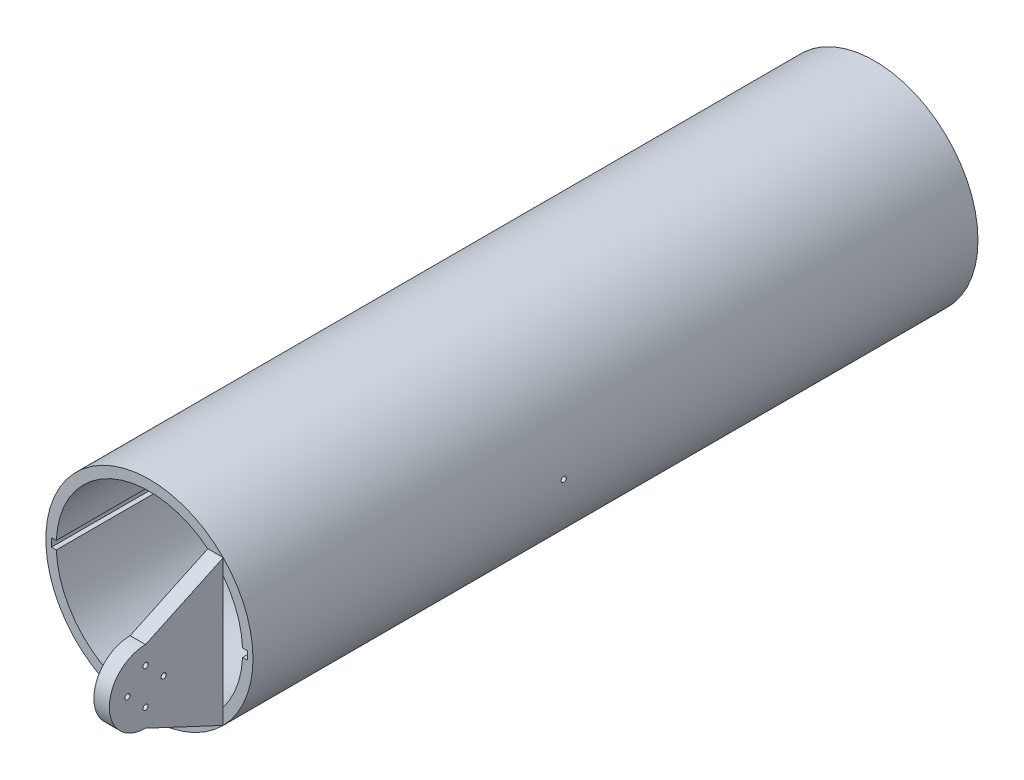
ISO-10303-21;
HEADER;
FILE_DESCRIPTION(('STEP AP214'),'2;1');
FILE_NAME('part.step','',(''),(''),'','','');
FILE_SCHEMA(('AUTOMOTIVE_DESIGN { 1 0 10303 214 1 1 1 1 }'));
ENDSEC;
DATA;
#1=APPLICATION_CONTEXT('core data for automotive mechanical design processes');
#2=APPLICATION_PROTOCOL_DEFINITION('international standard','automotive_design',2000,#1);
#3=PRODUCT_CONTEXT('',#1,'mechanical');
#4=PRODUCT('Part','Part','',(#3));
#5=PRODUCT_RELATED_PRODUCT_CATEGORY('part','',(#4));
#6=PRODUCT_DEFINITION_FORMATION('','',#4);
#7=PRODUCT_DEFINITION_CONTEXT('part definition',#1,'design');
#8=PRODUCT_DEFINITION('design','',#6,#7);
#9=PRODUCT_DEFINITION_SHAPE('','',#8);
#10=(LENGTH_UNIT() NAMED_UNIT(*) SI_UNIT(.MILLI.,.METRE.));
#11=(NAMED_UNIT(*) PLANE_ANGLE_UNIT() SI_UNIT($,.RADIAN.));
#12=(NAMED_UNIT(*) SI_UNIT($,.STERADIAN.) SOLID_ANGLE_UNIT());
#13=UNCERTAINTY_MEASURE_WITH_UNIT(LENGTH_MEASURE(1.E-05),#10,'distance_accuracy_value','');
#14=(GEOMETRIC_REPRESENTATION_CONTEXT(3) GLOBAL_UNCERTAINTY_ASSIGNED_CONTEXT((#13)) GLOBAL_UNIT_ASSIGNED_CONTEXT((#10,
#11,#12)) REPRESENTATION_CONTEXT('',''));
#15=CARTESIAN_POINT('',(0.,0.,0.));
#16=DIRECTION('',(0.,0.,1.));
#17=DIRECTION('',(1.,0.,0.));
#18=AXIS2_PLACEMENT_3D('',#15,#16,#17);
#19=CARTESIAN_POINT('',(0.,0.,-100.));
#20=DIRECTION('',(0.,0.,1.));
#21=DIRECTION('',(1.,0.,0.));
#22=AXIS2_PLACEMENT_3D('',#19,#20,#21);
#23=CYLINDRICAL_SURFACE('',#22,50.);
#24=CARTESIAN_POINT('',(-50.,0.,101.25));
#25=CARTESIAN_POINT('',(-49.9999997892433,-0.0702012806053509,101.249996890468));
#26=CARTESIAN_POINT('',(-49.9998505669129,-0.140453184521729,101.244066287815));
#27=CARTESIAN_POINT('',(-49.9992696347054,-0.279021411192673,101.220490687249));
#28=CARTESIAN_POINT('',(-49.9988375866143,-0.347335314234984,101.202831663669));
#29=CARTESIAN_POINT('',(-49.9977399359377,-0.480000032970664,101.156302971443));
#30=CARTESIAN_POINT('',(-49.9970744467966,-0.544352755839818,101.127438747421));
#31=CARTESIAN_POINT('',(-49.9955849996606,-0.66728119145738,101.059326712717));
#32=CARTESIAN_POINT('',(-49.9947610805834,-0.725858317628449,101.020081451217));
#33=CARTESIAN_POINT('',(-49.9930472282989,-0.835612011829375,100.932304373999));
#34=CARTESIAN_POINT('',(-49.9921572753778,-0.886786356266493,100.883769778147));
#35=CARTESIAN_POINT('',(-49.9904118342181,-0.980263255157657,100.778796235128));
#36=CARTESIAN_POINT('',(-49.9895563473475,-1.02256545779515,100.722356974657));
#37=CARTESIAN_POINT('',(-49.9879762331022,-1.09709940400727,100.603169665472));
#38=CARTESIAN_POINT('',(-49.9872516204449,-1.12933001528882,100.540420908464));
#39=CARTESIAN_POINT('',(-49.9860151168566,-1.1827984149725,100.410400905536));
#40=CARTESIAN_POINT('',(-49.9855032252025,-1.20403624074213,100.343129674991));
#41=CARTESIAN_POINT('',(-49.9847500083149,-1.23491198038136,100.205989232804));
#42=CARTESIAN_POINT('',(-49.9845086262981,-1.24455232873584,100.136120569578));
#43=CARTESIAN_POINT('',(-49.9843234739843,-1.25196695086035,99.9957562161149));
#44=CARTESIAN_POINT('',(-49.9843797026986,-1.24974126405586,99.925260527962));
#45=CARTESIAN_POINT('',(-49.9847833781213,-1.23348907585994,99.7856597612978));
#46=CARTESIAN_POINT('',(-49.9851307597476,-1.21946521174131,99.7165543755436));
#47=CARTESIAN_POINT('',(-49.9860774771185,-1.18001883030617,99.5816790450587));
#48=CARTESIAN_POINT('',(-49.9866768133296,-1.15459629188151,99.5159091065049));
#49=CARTESIAN_POINT('',(-49.9880599499198,-1.09307119196166,99.3895631952896));
#50=CARTESIAN_POINT('',(-49.988843771187,-1.0569674209775,99.3289878118357));
#51=CARTESIAN_POINT('',(-49.9905074926856,-0.975105623991352,99.21475701138));
#52=CARTESIAN_POINT('',(-49.9913873930577,-0.929347583862107,99.1611016045044));
#53=CARTESIAN_POINT('',(-49.9931443684604,-0.829461225210461,99.0622184655441));
#54=CARTESIAN_POINT('',(-49.9940214426512,-0.775330617915762,99.0169930454051));
#55=CARTESIAN_POINT('',(-49.9956736570713,-0.660243785237119,98.9362714726598));
#56=CARTESIAN_POINT('',(-49.9964487972851,-0.599287558820383,98.9007753215255));
#57=CARTESIAN_POINT('',(-49.9978097681651,-0.472278559451485,98.8405201705382));
#58=CARTESIAN_POINT('',(-49.9983955975763,-0.406225752717142,98.8157612418629));
#59=CARTESIAN_POINT('',(-49.9993118852416,-0.270899185047347,98.7776848280001));
#60=CARTESIAN_POINT('',(-49.9996423439818,-0.201625430244547,98.7643673210292));
#61=CARTESIAN_POINT('',(-50.0000105760241,-0.0618435041436848,98.7495546188588));
#62=CARTESIAN_POINT('',(-50.0000484285156,0.00866432799248807,98.7480562249943));
#63=CARTESIAN_POINT('',(-49.999827390649,0.148930569407979,98.7569159498476));
#64=CARTESIAN_POINT('',(-49.9995685005257,0.218688979279795,98.7672740591908));
#65=CARTESIAN_POINT('',(-49.9987832089567,0.355467259085124,98.7995501119755));
#66=CARTESIAN_POINT('',(-49.9982568410845,0.422487471571989,98.8214666046421));
#67=CARTESIAN_POINT('',(-49.9969959169746,0.551897387208432,98.876235815335));
#68=CARTESIAN_POINT('',(-49.9962613604543,0.614287084075191,98.9090885481995));
#69=CARTESIAN_POINT('',(-49.9946666309293,0.732679665489656,98.9848059046364));
#70=CARTESIAN_POINT('',(-49.9938064309167,0.788681172235662,99.0276726819793));
#71=CARTESIAN_POINT('',(-49.9920574600653,0.892693853571702,99.1221981272366));
#72=CARTESIAN_POINT('',(-49.9911686891723,0.940705013006051,99.1738568118267));
#73=CARTESIAN_POINT('',(-49.9894625477771,1.02738478773992,99.2845133569773));
#74=CARTESIAN_POINT('',(-49.9886451930737,1.06605133914107,99.3435128345125));
#75=CARTESIAN_POINT('',(-49.9871742851885,1.13293016503026,99.467167887786));
#76=CARTESIAN_POINT('',(-49.9865207316976,1.16114245925612,99.5318234528452));
#77=CARTESIAN_POINT('',(-49.9854512245261,1.20630831809067,99.6649475530868));
#78=CARTESIAN_POINT('',(-49.9850352425774,1.22326322223585,99.7334156335601));
#79=CARTESIAN_POINT('',(-49.9844876991685,1.24543740915402,99.8722276845196));
#80=CARTESIAN_POINT('',(-49.9843561376915,1.25065669262368,99.9425716548945));
#81=CARTESIAN_POINT('',(-49.9843922787728,1.24921131303956,100.08311792715));
#82=CARTESIAN_POINT('',(-49.9845598992096,1.242549911081,100.153320262613));
#83=CARTESIAN_POINT('',(-49.985175335134,1.21753894538223,100.291609864828));
#84=CARTESIAN_POINT('',(-49.98562315118,1.19918935835732,100.359697127367));
#85=CARTESIAN_POINT('',(-49.986748485414,1.15132321438058,100.49182541808));
#86=CARTESIAN_POINT('',(-49.9874260076321,1.12180646151248,100.555866375244));
#87=CARTESIAN_POINT('',(-49.9889343430816,1.05244537142006,100.678082151641));
#88=CARTESIAN_POINT('',(-49.9897651506242,1.01260141744787,100.736257188454));
#89=CARTESIAN_POINT('',(-49.9914866049636,0.92370883247783,100.845103812792));
#90=CARTESIAN_POINT('',(-49.992377261793,0.874658655736825,100.895774137701));
#91=CARTESIAN_POINT('',(-49.994118137793,0.768733478143212,100.988174453478));
#92=CARTESIAN_POINT('',(-49.9949683468844,0.711856540554558,101.02990222495));
#93=CARTESIAN_POINT('',(-49.9965327264857,0.591873911934435,101.103237927888));
#94=CARTESIAN_POINT('',(-49.9972468156398,0.528764529907139,101.134839814985));
#95=CARTESIAN_POINT('',(-49.998456932991,0.398183073403346,101.186962967462));
#96=CARTESIAN_POINT('',(-49.9989532215103,0.330716318304683,101.207497467673));
#97=CARTESIAN_POINT('',(-49.999538941339,0.219018516921423,101.231451616862));
#98=CARTESIAN_POINT('',(-49.9997110897919,0.175512722018037,101.238398530281));
#99=CARTESIAN_POINT('',(-49.9999416851822,0.0880112516517628,101.247673696205));
#100=CARTESIAN_POINT('',(-50.0000001321426,0.0440155762883697,101.250001949649));
#101=CARTESIAN_POINT('',(-50.,0.,101.25));
#102=B_SPLINE_CURVE_WITH_KNOTS('',3,(#24,#25,#26,#27,#28,#29,#30,#31,#32,#33,#34,#35,#36,#37,
#38,#39,#40,#41,#42,#43,#44,#45,#46,#47,#48,#49,#50,#51,#52,#53,#54,#55,#56,#57,#58,#59,#60,#61,
#62,#63,#64,#65,#66,#67,#68,#69,#70,#71,#72,#73,#74,#75,#76,#77,#78,#79,#80,#81,#82,#83,#84,#85,
#86,#87,#88,#89,#90,#91,#92,#93,#94,#95,#96,#97,#98,#99,#100,#101),.UNSPECIFIED.,.T.,.F.,(4,2,2,
2,2,2,2,2,2,2,2,2,2,2,2,2,2,2,2,2,2,2,2,2,2,2,2,2,2,2,2,2,2,2,2,2,2,2,4),(0.,0.210443181033347,
0.421138479019948,0.631731527740004,0.842272910862806,1.05287740411288,1.26349024711038,
1.47412675962819,1.68476255612964,1.89535412929105,2.10594500275222,2.31648881487096,
2.52703301687766,2.73760106897999,2.94816942921227,3.15879545366897,3.36942150999579,
3.58004896255672,3.79067601410156,4.00124606064959,4.21181594070732,4.42235939693014,
4.63290313881923,4.84349220516216,5.05408167093516,5.26471760616385,5.47535314370606,
5.68596361286427,5.89657406951998,6.10712672521302,6.3176798003613,6.5282365696147,
6.73878552602708,6.94936986570474,7.16000640860575,7.37076845199211,7.58127789517965,
7.71322391796614,7.84516991395463),.UNSPECIFIED.);
#103=CARTESIAN_POINT('',(-50.,0.,101.25));
#104=VERTEX_POINT('',#103);
#105=EDGE_CURVE('E265',#104,#104,#102,.T.);
#106=ORIENTED_EDGE('',*,*,#105,.T.);
#107=EDGE_LOOP('',(#106));
#108=FACE_BOUND('',#107,.T.);
#109=CARTESIAN_POINT('',(0.,0.,-100.));
#110=DIRECTION('',(0.,0.,1.));
#111=DIRECTION('',(1.,0.,0.));
#112=AXIS2_PLACEMENT_3D('',#109,#110,#111);
#113=CIRCLE('',#112,50.);
#114=CARTESIAN_POINT('',(50.,0.,-100.));
#115=VERTEX_POINT('',#114);
#116=EDGE_CURVE('E207',#115,#115,#113,.T.);
#117=ORIENTED_EDGE('',*,*,#116,.T.);
#118=EDGE_LOOP('',(#117));
#119=FACE_BOUND('',#118,.T.);
#120=CARTESIAN_POINT('',(0.,0.,250.));
#121=DIRECTION('',(0.,0.,1.));
#122=DIRECTION('',(1.,0.,0.));
#123=AXIS2_PLACEMENT_3D('',#120,#121,#122);
#124=CIRCLE('',#123,50.);
#125=CARTESIAN_POINT('',(35.6404264845415,35.0679340708858,250.));
#126=VERTEX_POINT('',#125);
#127=CARTESIAN_POINT('',(35.6404264845415,-35.0679340708858,250.));
#128=VERTEX_POINT('',#127);
#129=EDGE_CURVE('E134',#126,#128,#124,.T.);
#130=ORIENTED_EDGE('',*,*,#129,.F.);
#131=EDGE_CURVE('E145',#128,#126,#124,.T.);
#132=ORIENTED_EDGE('',*,*,#131,.F.);
#133=EDGE_LOOP('',(#130,#132));
#134=FACE_BOUND('',#133,.T.);
#135=CARTESIAN_POINT('',(50.,0.,98.75));
#136=CARTESIAN_POINT('',(49.9999997892433,-0.0702012806053509,98.7500031095318));
#137=CARTESIAN_POINT('',(49.9998505669129,-0.140453184521729,98.7559337121853));
#138=CARTESIAN_POINT('',(49.9992696347054,-0.279021411192673,98.7795093127506));
#139=CARTESIAN_POINT('',(49.9988375866143,-0.347335314234984,98.7971683363312));
#140=CARTESIAN_POINT('',(49.9977399359377,-0.480000032970663,98.843697028557));
#141=CARTESIAN_POINT('',(49.9970744467966,-0.544352755839814,98.8725612525791));
#142=CARTESIAN_POINT('',(49.9955849996606,-0.667281191457376,98.9406732872833));
#143=CARTESIAN_POINT('',(49.9947610805834,-0.725858317628445,98.979918548783));
#144=CARTESIAN_POINT('',(49.9930472282989,-0.83561201182937,99.0676956260013));
#145=CARTESIAN_POINT('',(49.9921572753778,-0.886786356266485,99.1162302218535));
#146=CARTESIAN_POINT('',(49.9904118342181,-0.980263255157651,99.221203764872));
#147=CARTESIAN_POINT('',(49.9895563473475,-1.02256545779515,99.2776430253426));
#148=CARTESIAN_POINT('',(49.9879762331022,-1.09709940400727,99.3968303345276));
#149=CARTESIAN_POINT('',(49.9872516204449,-1.12933001528882,99.4595790915363));
#150=CARTESIAN_POINT('',(49.9860151168566,-1.1827984149725,99.5895990944642));
#151=CARTESIAN_POINT('',(49.9855032252025,-1.20403624074213,99.6568703250093));
#152=CARTESIAN_POINT('',(49.9847500083149,-1.23491198038136,99.7940107671962));
#153=CARTESIAN_POINT('',(49.9845086262981,-1.24455232873584,99.8638794304222));
#154=CARTESIAN_POINT('',(49.9843234739843,-1.25196695086035,100.004243783885));
#155=CARTESIAN_POINT('',(49.9843797026986,-1.24974126405586,100.074739472038));
#156=CARTESIAN_POINT('',(49.9847833781213,-1.23348907585994,100.214340238702));
#157=CARTESIAN_POINT('',(49.9851307597476,-1.21946521174131,100.283445624456));
#158=CARTESIAN_POINT('',(49.9860774771185,-1.18001883030616,100.418320954941));
#159=CARTESIAN_POINT('',(49.9866768133296,-1.15459629188151,100.484090893495));
#160=CARTESIAN_POINT('',(49.9880599499198,-1.09307119196166,100.61043680471));
#161=CARTESIAN_POINT('',(49.988843771187,-1.0569674209775,100.671012188164));
#162=CARTESIAN_POINT('',(49.9905074926856,-0.975105623991352,100.78524298862));
#163=CARTESIAN_POINT('',(49.9913873930577,-0.929347583862107,100.838898395496));
#164=CARTESIAN_POINT('',(49.9931443684604,-0.829461225210461,100.937781534456));
#165=CARTESIAN_POINT('',(49.9940214426512,-0.775330617915762,100.983006954595));
#166=CARTESIAN_POINT('',(49.9956736570713,-0.660243785237119,101.06372852734));
#167=CARTESIAN_POINT('',(49.9964487972851,-0.599287558820383,101.099224678474));
#168=CARTESIAN_POINT('',(49.9978097681651,-0.472278559451484,101.159479829462));
#169=CARTESIAN_POINT('',(49.9983955975763,-0.406225752717139,101.184238758137));
#170=CARTESIAN_POINT('',(49.9993118852416,-0.270899185047344,101.222315172));
#171=CARTESIAN_POINT('',(49.9996423439818,-0.201625430244546,101.235632678971));
#172=CARTESIAN_POINT('',(50.0000105760241,-0.0618435041436857,101.250445381141));
#173=CARTESIAN_POINT('',(50.0000484285156,0.0086643279924863,101.251943775006));
#174=CARTESIAN_POINT('',(49.999827390649,0.148930569407977,101.243084050152));
#175=CARTESIAN_POINT('',(49.9995685005257,0.218688979279794,101.232725940809));
#176=CARTESIAN_POINT('',(49.9987832089567,0.355467259085124,101.200449888024));
#177=CARTESIAN_POINT('',(49.9982568410845,0.422487471571989,101.178533395358));
#178=CARTESIAN_POINT('',(49.9969959169746,0.551897387208432,101.123764184665));
#179=CARTESIAN_POINT('',(49.9962613604543,0.614287084075191,101.090911451801));
#180=CARTESIAN_POINT('',(49.9946666309293,0.732679665489651,101.015194095364));
#181=CARTESIAN_POINT('',(49.9938064309167,0.788681172235652,100.972327318021));
#182=CARTESIAN_POINT('',(49.9920574600653,0.892693853571693,100.877801872763));
#183=CARTESIAN_POINT('',(49.9911686891723,0.940705013006047,100.826143188173));
#184=CARTESIAN_POINT('',(49.9894625477771,1.02738478773992,100.715486643023));
#185=CARTESIAN_POINT('',(49.9886451930737,1.06605133914107,100.656487165487));
#186=CARTESIAN_POINT('',(49.9871742851885,1.13293016503026,100.532832112214));
#187=CARTESIAN_POINT('',(49.9865207316976,1.16114245925612,100.468176547155));
#188=CARTESIAN_POINT('',(49.9854512245261,1.20630831809067,100.335052446913));
#189=CARTESIAN_POINT('',(49.9850352425774,1.22326322223584,100.26658436644));
#190=CARTESIAN_POINT('',(49.9844876991685,1.24543740915402,100.12777231548));
#191=CARTESIAN_POINT('',(49.9843561376915,1.25065669262368,100.057428345106));
#192=CARTESIAN_POINT('',(49.9843922787728,1.24921131303956,99.9168820728496));
#193=CARTESIAN_POINT('',(49.9845598992096,1.242549911081,99.8466797373866));
#194=CARTESIAN_POINT('',(49.985175335134,1.21753894538223,99.7083901351715));
#195=CARTESIAN_POINT('',(49.98562315118,1.19918935835732,99.6403028726333));
#196=CARTESIAN_POINT('',(49.986748485414,1.15132321438058,99.5081745819201));
#197=CARTESIAN_POINT('',(49.9874260076321,1.12180646151248,99.4441336247564));
#198=CARTESIAN_POINT('',(49.9889343430816,1.05244537142006,99.3219178483587));
#199=CARTESIAN_POINT('',(49.9897651506242,1.01260141744787,99.2637428115462));
#200=CARTESIAN_POINT('',(49.9914866049636,0.92370883247783,99.1548961872083));
#201=CARTESIAN_POINT('',(49.992377261793,0.874658655736825,99.1042258622989));
#202=CARTESIAN_POINT('',(49.994118137793,0.768733478143212,99.0118255465219));
#203=CARTESIAN_POINT('',(49.9949683468844,0.711856540554558,98.97009777505));
#204=CARTESIAN_POINT('',(49.9965327264857,0.591873911934435,98.896762072112));
#205=CARTESIAN_POINT('',(49.9972468156398,0.528764529907139,98.8651601850151));
#206=CARTESIAN_POINT('',(49.998456932991,0.398183073403346,98.8130370325382));
#207=CARTESIAN_POINT('',(49.9989532215103,0.330716318304683,98.7925025323275));
#208=CARTESIAN_POINT('',(49.999538941339,0.219018516921423,98.7685483831377));
#209=CARTESIAN_POINT('',(49.9997110897919,0.175512722018037,98.7616014697195));
#210=CARTESIAN_POINT('',(49.9999416851822,0.0880112516517628,98.7523263037953));
#211=CARTESIAN_POINT('',(50.0000001321426,0.0440155762883697,98.7499980503513));
#212=CARTESIAN_POINT('',(50.,0.,98.75));
#213=B_SPLINE_CURVE_WITH_KNOTS('',3,(#135,#136,#137,#138,#139,#140,#141,#142,#143,#144,#145,
#146,#147,#148,#149,#150,#151,#152,#153,#154,#155,#156,#157,#158,#159,#160,#161,#162,#163,#164,
#165,#166,#167,#168,#169,#170,#171,#172,#173,#174,#175,#176,#177,#178,#179,#180,#181,#182,#183,
#184,#185,#186,#187,#188,#189,#190,#191,#192,#193,#194,#195,#196,#197,#198,#199,#200,#201,#202,
#203,#204,#205,#206,#207,#208,#209,#210,#211,#212),.UNSPECIFIED.,.T.,.F.,(4,2,2,2,2,2,2,2,2,2,2,
2,2,2,2,2,2,2,2,2,2,2,2,2,2,2,2,2,2,2,2,2,2,2,2,2,2,2,4),(0.,0.210443181033347,
0.421138479019948,0.631731527739999,0.842272910862806,1.05287740411285,1.26349024711038,
1.47412675962819,1.68476255612964,1.89535412929105,2.10594500275222,2.31648881487098,
2.52703301687767,2.73760106897999,2.94816942921227,3.15879545366897,3.3694215099958,
3.58004896255672,3.79067601410156,4.00124606064959,4.21181594070732,4.42235939693014,
4.63290313881924,4.84349220516214,5.05408167093516,5.26471760616385,5.47535314370606,
5.68596361286423,5.89657406951999,6.10712672521302,6.31767980036131,6.5282365696147,
6.73878552602708,6.94936986570474,7.16000640860575,7.37076845199211,7.58127789517965,
7.71322391796614,7.84516991395463),.UNSPECIFIED.);
#214=CARTESIAN_POINT('',(50.,0.,98.75));
#215=VERTEX_POINT('',#214);
#216=EDGE_CURVE('E155',#215,#215,#213,.T.);
#217=ORIENTED_EDGE('',*,*,#216,.T.);
#218=EDGE_LOOP('',(#217));
#219=FACE_BOUND('',#218,.T.);
#220=ADVANCED_FACE('F34',(#108,#119,#134,#219),#23,.T.);
#221=CARTESIAN_POINT('',(47.2555555555554,1.99950611185836,-100.));
#222=DIRECTION('',(1.,0.,0.));
#223=DIRECTION('',(0.,1.,0.));
#224=AXIS2_PLACEMENT_3D('',#221,#222,#223);
#225=PLANE('',#224);
#226=DIRECTION('',(0.,0.,1.));
#227=VECTOR('',#226,1.);
#228=CARTESIAN_POINT('',(47.2555555555555,-1.99950611185791,-100.));
#229=LINE('',#228,#227);
#230=CARTESIAN_POINT('',(47.2555555555555,-1.99950611185791,-100.));
#231=VERTEX_POINT('',#230);
#232=CARTESIAN_POINT('',(47.2555555555555,-1.99950611185791,250.));
#233=VERTEX_POINT('',#232);
#234=EDGE_CURVE('E210',#231,#233,#229,.T.);
#235=ORIENTED_EDGE('',*,*,#234,.T.);
#236=DIRECTION('',(0.,1.,0.));
#237=VECTOR('',#236,1.);
#238=CARTESIAN_POINT('',(47.2555555555554,1.99950611185836,250.));
#239=LINE('',#238,#237);
#240=CARTESIAN_POINT('',(47.2555555555554,1.99950611185836,250.));
#241=VERTEX_POINT('',#240);
#242=EDGE_CURVE('E179',#233,#241,#239,.T.);
#243=ORIENTED_EDGE('',*,*,#242,.T.);
#244=DIRECTION('',(0.,0.,1.));
#245=VECTOR('',#244,1.);
#246=CARTESIAN_POINT('',(47.2555555555554,1.99950611185836,-100.));
#247=LINE('',#246,#245);
#248=CARTESIAN_POINT('',(47.2555555555554,1.99950611185836,-100.));
#249=VERTEX_POINT('',#248);
#250=EDGE_CURVE('E208',#249,#241,#247,.T.);
#251=ORIENTED_EDGE('',*,*,#250,.F.);
#252=DIRECTION('',(0.,1.,0.));
#253=VECTOR('',#252,1.);
#254=CARTESIAN_POINT('',(47.2555555555554,1.99950611185836,-100.));
#255=LINE('',#254,#253);
#256=EDGE_CURVE('E198',#231,#249,#255,.T.);
#257=ORIENTED_EDGE('',*,*,#256,.F.);
#258=EDGE_LOOP('',(#235,#243,#251,#257));
#259=FACE_BOUND('',#258,.T.);
#260=CARTESIAN_POINT('',(47.2555555555555,0.,100.));
#261=DIRECTION('',(1.,0.,0.));
#262=DIRECTION('',(0.,1.,0.));
#263=AXIS2_PLACEMENT_3D('',#260,#261,#262);
#264=CIRCLE('',#263,1.25);
#265=CARTESIAN_POINT('',(47.2555555555554,1.25,100.));
#266=VERTEX_POINT('',#265);
#267=EDGE_CURVE('E228',#266,#266,#264,.F.);
#268=ORIENTED_EDGE('',*,*,#267,.F.);
#269=EDGE_LOOP('',(#268));
#270=FACE_BOUND('',#269,.T.);
#271=ADVANCED_FACE('F304',(#259,#270),#225,.F.);
#272=CARTESIAN_POINT('',(-47.2555555555556,1.99950611185813,-100.));
#273=DIRECTION('',(-1.,0.,0.));
#274=DIRECTION('',(0.,0.,1.));
#275=AXIS2_PLACEMENT_3D('',#272,#273,#274);
#276=PLANE('',#275);
#277=DIRECTION('',(0.,0.,1.));
#278=VECTOR('',#277,1.);
#279=CARTESIAN_POINT('',(-47.2555555555556,1.99950611185813,-100.));
#280=LINE('',#279,#278);
#281=CARTESIAN_POINT('',(-47.2555555555556,1.99950611185813,-100.));
#282=VERTEX_POINT('',#281);
#283=CARTESIAN_POINT('',(-47.2555555555556,1.99950611185813,250.));
#284=VERTEX_POINT('',#283);
#285=EDGE_CURVE('E219',#282,#284,#280,.T.);
#286=ORIENTED_EDGE('',*,*,#285,.T.);
#287=DIRECTION('',(0.,-1.,0.));
#288=VECTOR('',#287,1.);
#289=CARTESIAN_POINT('',(-47.2555555555556,1.99950611185813,250.));
#290=LINE('',#289,#288);
#291=CARTESIAN_POINT('',(-47.2555555555556,-1.99950611185813,250.));
#292=VERTEX_POINT('',#291);
#293=EDGE_CURVE('E536',#284,#292,#290,.T.);
#294=ORIENTED_EDGE('',*,*,#293,.T.);
#295=DIRECTION('',(0.,0.,1.));
#296=VECTOR('',#295,1.);
#297=CARTESIAN_POINT('',(-47.2555555555556,-1.99950611185813,-100.));
#298=LINE('',#297,#296);
#299=CARTESIAN_POINT('',(-47.2555555555556,-1.99950611185813,-100.));
#300=VERTEX_POINT('',#299);
#301=EDGE_CURVE('E217',#300,#292,#298,.T.);
#302=ORIENTED_EDGE('',*,*,#301,.F.);
#303=DIRECTION('',(0.,-1.,0.));
#304=VECTOR('',#303,1.);
#305=CARTESIAN_POINT('',(-47.2555555555556,1.99950611185813,-100.));
#306=LINE('',#305,#304);
#307=EDGE_CURVE('E59',#282,#300,#306,.T.);
#308=ORIENTED_EDGE('',*,*,#307,.F.);
#309=EDGE_LOOP('',(#286,#294,#302,#308));
#310=FACE_BOUND('',#309,.T.);
#311=CARTESIAN_POINT('',(-47.2555555555556,0.,100.));
#312=DIRECTION('',(-1.,0.,0.));
#313=DIRECTION('',(0.,0.,1.));
#314=AXIS2_PLACEMENT_3D('',#311,#312,#313);
#315=CIRCLE('',#314,1.25);
#316=CARTESIAN_POINT('',(-47.2555555555556,0.,101.25));
#317=VERTEX_POINT('',#316);
#318=EDGE_CURVE('E225',#317,#317,#315,.F.);
#319=ORIENTED_EDGE('',*,*,#318,.F.);
#320=EDGE_LOOP('',(#319));
#321=FACE_BOUND('',#320,.T.);
#322=ADVANCED_FACE('F307',(#310,#321),#276,.F.);
#323=CARTESIAN_POINT('',(0.,0.,250.));
#324=DIRECTION('',(0.,0.,1.));
#325=DIRECTION('',(1.,0.,0.));
#326=AXIS2_PLACEMENT_3D('',#323,#324,#325);
#327=PLANE('',#326);
#328=DIRECTION('',(1.,0.,0.));
#329=VECTOR('',#328,1.);
#330=CARTESIAN_POINT('',(35.6404264845415,-35.0679340708858,250.));
#331=LINE('',#330,#329);
#332=CARTESIAN_POINT('',(28.2,-35.0679340708858,250.));
#333=VERTEX_POINT('',#332);
#334=EDGE_CURVE('E138',#333,#128,#331,.T.);
#335=ORIENTED_EDGE('',*,*,#334,.F.);
#336=CARTESIAN_POINT('',(0.,0.,250.));
#337=DIRECTION('',(0.,0.,1.));
#338=DIRECTION('',(1.,0.,0.));
#339=AXIS2_PLACEMENT_3D('',#336,#337,#338);
#340=CIRCLE('',#339,45.);
#341=CARTESIAN_POINT('',(-44.9555555555556,-1.99950611185813,250.));
#342=VERTEX_POINT('',#341);
#343=EDGE_CURVE('E542',#342,#333,#340,.T.);
#344=ORIENTED_EDGE('',*,*,#343,.F.);
#345=DIRECTION('',(1.,0.,0.));
#346=VECTOR('',#345,1.);
#347=CARTESIAN_POINT('',(-44.9555555555556,-1.99950611185813,250.));
#348=LINE('',#347,#346);
#349=EDGE_CURVE('E539',#292,#342,#348,.T.);
#350=ORIENTED_EDGE('',*,*,#349,.F.);
#351=ORIENTED_EDGE('',*,*,#293,.F.);
#352=DIRECTION('',(-1.,0.,0.));
#353=VECTOR('',#352,1.);
#354=CARTESIAN_POINT('',(-44.9555555555556,1.99950611185813,250.));
#355=LINE('',#354,#353);
#356=CARTESIAN_POINT('',(-44.9555555555556,1.99950611185813,250.));
#357=VERTEX_POINT('',#356);
#358=EDGE_CURVE('E533',#357,#284,#355,.T.);
#359=ORIENTED_EDGE('',*,*,#358,.F.);
#360=CARTESIAN_POINT('',(0.,0.,250.));
#361=DIRECTION('',(0.,0.,1.));
#362=DIRECTION('',(1.,0.,0.));
#363=AXIS2_PLACEMENT_3D('',#360,#361,#362);
#364=CIRCLE('',#363,45.);
#365=CARTESIAN_POINT('',(28.2,35.0679340708858,250.));
#366=VERTEX_POINT('',#365);
#367=EDGE_CURVE('E526',#366,#357,#364,.T.);
#368=ORIENTED_EDGE('',*,*,#367,.F.);
#369=DIRECTION('',(-1.,0.,0.));
#370=VECTOR('',#369,1.);
#371=CARTESIAN_POINT('',(28.2,35.0679340708858,250.));
#372=LINE('',#371,#370);
#373=EDGE_CURVE('E141',#126,#366,#372,.T.);
#374=ORIENTED_EDGE('',*,*,#373,.F.);
#375=ORIENTED_EDGE('',*,*,#129,.T.);
#376=EDGE_LOOP('',(#335,#344,#350,#351,#359,#368,#374,#375));
#377=FACE_BOUND('',#376,.T.);
#378=ADVANCED_FACE('F136',(#377),#327,.T.);
#379=CARTESIAN_POINT('',(0.,0.,-100.));
#380=DIRECTION('',(0.,0.,1.));
#381=DIRECTION('',(1.,0.,0.));
#382=AXIS2_PLACEMENT_3D('',#379,#380,#381);
#383=PLANE('',#382);
#384=DIRECTION('',(-1.,0.,0.));
#385=VECTOR('',#384,1.);
#386=CARTESIAN_POINT('',(44.9555555555554,1.99950611185834,-100.));
#387=LINE('',#386,#385);
#388=CARTESIAN_POINT('',(44.9555555555554,1.99950611185834,-100.));
#389=VERTEX_POINT('',#388);
#390=EDGE_CURVE('E201',#249,#389,#387,.T.);
#391=ORIENTED_EDGE('',*,*,#390,.T.);
#392=CARTESIAN_POINT('',(0.,0.,-100.));
#393=DIRECTION('',(0.,0.,1.));
#394=DIRECTION('',(1.,0.,0.));
#395=AXIS2_PLACEMENT_3D('',#392,#393,#394);
#396=CIRCLE('',#395,45.);
#397=CARTESIAN_POINT('',(-44.9555555555556,1.99950611185813,-100.));
#398=VERTEX_POINT('',#397);
#399=EDGE_CURVE('E144',#389,#398,#396,.T.);
#400=ORIENTED_EDGE('',*,*,#399,.T.);
#401=DIRECTION('',(-1.,0.,0.));
#402=VECTOR('',#401,1.);
#403=CARTESIAN_POINT('',(-44.9555555555556,1.99950611185813,-100.));
#404=LINE('',#403,#402);
#405=EDGE_CURVE('E185',#398,#282,#404,.T.);
#406=ORIENTED_EDGE('',*,*,#405,.T.);
#407=ORIENTED_EDGE('',*,*,#307,.T.);
#408=DIRECTION('',(1.,0.,0.));
#409=VECTOR('',#408,1.);
#410=CARTESIAN_POINT('',(-44.9555555555556,-1.99950611185813,-100.));
#411=LINE('',#410,#409);
#412=CARTESIAN_POINT('',(-44.9555555555556,-1.99950611185813,-100.));
#413=VERTEX_POINT('',#412);
#414=EDGE_CURVE('E189',#300,#413,#411,.T.);
#415=ORIENTED_EDGE('',*,*,#414,.T.);
#416=CARTESIAN_POINT('',(0.,0.,-100.));
#417=DIRECTION('',(0.,0.,1.));
#418=DIRECTION('',(1.,0.,0.));
#419=AXIS2_PLACEMENT_3D('',#416,#417,#418);
#420=CIRCLE('',#419,45.);
#421=CARTESIAN_POINT('',(44.9555555555555,-1.99950611185793,-100.));
#422=VERTEX_POINT('',#421);
#423=EDGE_CURVE('E192',#413,#422,#420,.T.);
#424=ORIENTED_EDGE('',*,*,#423,.T.);
#425=DIRECTION('',(1.,0.,0.));
#426=VECTOR('',#425,1.);
#427=CARTESIAN_POINT('',(44.9555555555555,-1.99950611185793,-100.));
#428=LINE('',#427,#426);
#429=EDGE_CURVE('E195',#422,#231,#428,.T.);
#430=ORIENTED_EDGE('',*,*,#429,.T.);
#431=ORIENTED_EDGE('',*,*,#256,.T.);
#432=EDGE_LOOP('',(#391,#400,#406,#407,#415,#424,#430,#431));
#433=FACE_BOUND('',#432,.T.);
#434=ORIENTED_EDGE('',*,*,#116,.F.);
#435=EDGE_LOOP('',(#434));
#436=FACE_BOUND('',#435,.T.);
#437=ADVANCED_FACE('F326',(#433,#436),#383,.F.);
#438=CARTESIAN_POINT('',(0.,0.,-100.));
#439=DIRECTION('',(0.,0.,1.));
#440=DIRECTION('',(1.,0.,0.));
#441=AXIS2_PLACEMENT_3D('',#438,#439,#440);
#442=CYLINDRICAL_SURFACE('',#441,45.);
#443=DIRECTION('',(0.,0.,1.));
#444=VECTOR('',#443,1.);
#445=CARTESIAN_POINT('',(44.9555555555554,1.99950611185834,-100.));
#446=LINE('',#445,#444);
#447=CARTESIAN_POINT('',(44.9555555555554,1.99950611185834,250.));
#448=VERTEX_POINT('',#447);
#449=EDGE_CURVE('E205',#389,#448,#446,.T.);
#450=ORIENTED_EDGE('',*,*,#449,.T.);
#451=CARTESIAN_POINT('',(35.6404264845415,27.4728957337954,250.));
#452=VERTEX_POINT('',#451);
#453=EDGE_CURVE('E530',#448,#452,#364,.T.);
#454=ORIENTED_EDGE('',*,*,#453,.T.);
#455=EDGE_CURVE('E528',#452,#366,#364,.T.);
#456=ORIENTED_EDGE('',*,*,#455,.T.);
#457=ORIENTED_EDGE('',*,*,#367,.T.);
#458=DIRECTION('',(0.,0.,1.));
#459=VECTOR('',#458,1.);
#460=CARTESIAN_POINT('',(-44.9555555555556,1.99950611185813,-100.));
#461=LINE('',#460,#459);
#462=EDGE_CURVE('E204',#398,#357,#461,.T.);
#463=ORIENTED_EDGE('',*,*,#462,.F.);
#464=ORIENTED_EDGE('',*,*,#399,.F.);
#465=EDGE_LOOP('',(#450,#454,#456,#457,#463,#464));
#466=FACE_BOUND('',#465,.T.);
#467=ADVANCED_FACE('F302',(#466),#442,.F.);
#468=CARTESIAN_POINT('',(44.9555555555554,1.99950611185834,-100.));
#469=DIRECTION('',(0.,1.,0.));
#470=DIRECTION('',(-1.,0.,0.));
#471=AXIS2_PLACEMENT_3D('',#468,#469,#470);
#472=PLANE('',#471);
#473=ORIENTED_EDGE('',*,*,#250,.T.);
#474=DIRECTION('',(-1.,0.,0.));
#475=VECTOR('',#474,1.);
#476=CARTESIAN_POINT('',(44.9555555555554,1.99950611185834,250.));
#477=LINE('',#476,#475);
#478=EDGE_CURVE('E177',#241,#448,#477,.T.);
#479=ORIENTED_EDGE('',*,*,#478,.T.);
#480=ORIENTED_EDGE('',*,*,#449,.F.);
#481=ORIENTED_EDGE('',*,*,#390,.F.);
#482=EDGE_LOOP('',(#473,#479,#480,#481));
#483=FACE_BOUND('',#482,.T.);
#484=ADVANCED_FACE('F298',(#483),#472,.F.);
#485=CARTESIAN_POINT('',(44.9555555555555,-1.99950611185793,-100.));
#486=DIRECTION('',(0.,-1.,0.));
#487=DIRECTION('',(1.,0.,0.));
#488=AXIS2_PLACEMENT_3D('',#485,#486,#487);
#489=PLANE('',#488);
#490=DIRECTION('',(0.,0.,1.));
#491=VECTOR('',#490,1.);
#492=CARTESIAN_POINT('',(44.9555555555555,-1.99950611185793,-100.));
#493=LINE('',#492,#491);
#494=CARTESIAN_POINT('',(44.9555555555555,-1.99950611185793,250.));
#495=VERTEX_POINT('',#494);
#496=EDGE_CURVE('E212',#422,#495,#493,.T.);
#497=ORIENTED_EDGE('',*,*,#496,.T.);
#498=DIRECTION('',(1.,0.,0.));
#499=VECTOR('',#498,1.);
#500=CARTESIAN_POINT('',(44.9555555555555,-1.99950611185793,250.));
#501=LINE('',#500,#499);
#502=EDGE_CURVE('E544',#495,#233,#501,.T.);
#503=ORIENTED_EDGE('',*,*,#502,.T.);
#504=ORIENTED_EDGE('',*,*,#234,.F.);
#505=ORIENTED_EDGE('',*,*,#429,.F.);
#506=EDGE_LOOP('',(#497,#503,#504,#505));
#507=FACE_BOUND('',#506,.T.);
#508=ADVANCED_FACE('F301',(#507),#489,.F.);
#509=CARTESIAN_POINT('',(0.,0.,-100.));
#510=DIRECTION('',(0.,0.,1.));
#511=DIRECTION('',(1.,0.,0.));
#512=AXIS2_PLACEMENT_3D('',#509,#510,#511);
#513=CYLINDRICAL_SURFACE('',#512,45.);
#514=DIRECTION('',(0.,0.,1.));
#515=VECTOR('',#514,1.);
#516=CARTESIAN_POINT('',(-44.9555555555556,-1.99950611185813,-100.));
#517=LINE('',#516,#515);
#518=EDGE_CURVE('E215',#413,#342,#517,.T.);
#519=ORIENTED_EDGE('',*,*,#518,.T.);
#520=ORIENTED_EDGE('',*,*,#343,.T.);
#521=CARTESIAN_POINT('',(35.6404264845415,-27.4728957337954,250.));
#522=VERTEX_POINT('',#521);
#523=EDGE_CURVE('E545',#333,#522,#340,.T.);
#524=ORIENTED_EDGE('',*,*,#523,.T.);
#525=EDGE_CURVE('E173',#522,#495,#340,.T.);
#526=ORIENTED_EDGE('',*,*,#525,.T.);
#527=ORIENTED_EDGE('',*,*,#496,.F.);
#528=ORIENTED_EDGE('',*,*,#423,.F.);
#529=EDGE_LOOP('',(#519,#520,#524,#526,#527,#528));
#530=FACE_BOUND('',#529,.T.);
#531=ADVANCED_FACE('F311',(#530),#513,.F.);
#532=CARTESIAN_POINT('',(-44.9555555555556,-1.99950611185813,-100.));
#533=DIRECTION('',(0.,-1.,0.));
#534=DIRECTION('',(0.,0.,-1.));
#535=AXIS2_PLACEMENT_3D('',#532,#533,#534);
#536=PLANE('',#535);
#537=ORIENTED_EDGE('',*,*,#301,.T.);
#538=ORIENTED_EDGE('',*,*,#349,.T.);
#539=ORIENTED_EDGE('',*,*,#518,.F.);
#540=ORIENTED_EDGE('',*,*,#414,.F.);
#541=EDGE_LOOP('',(#537,#538,#539,#540));
#542=FACE_BOUND('',#541,.T.);
#543=ADVANCED_FACE('F315',(#542),#536,.F.);
#544=CARTESIAN_POINT('',(-44.9555555555556,1.99950611185813,-100.));
#545=DIRECTION('',(0.,1.,0.));
#546=DIRECTION('',(0.,0.,1.));
#547=AXIS2_PLACEMENT_3D('',#544,#545,#546);
#548=PLANE('',#547);
#549=ORIENTED_EDGE('',*,*,#462,.T.);
#550=ORIENTED_EDGE('',*,*,#358,.T.);
#551=ORIENTED_EDGE('',*,*,#285,.F.);
#552=ORIENTED_EDGE('',*,*,#405,.F.);
#553=EDGE_LOOP('',(#549,#550,#551,#552));
#554=FACE_BOUND('',#553,.T.);
#555=ADVANCED_FACE('F297',(#554),#548,.F.);
#556=DIRECTION('',(0.,1.,0.));
#557=VECTOR('',#556,1.);
#558=CARTESIAN_POINT('',(35.6404264845415,35.0679340708858,250.));
#559=LINE('',#558,#557);
#560=EDGE_CURVE('E162',#128,#522,#559,.T.);
#561=ORIENTED_EDGE('',*,*,#560,.F.);
#562=ORIENTED_EDGE('',*,*,#131,.T.);
#563=EDGE_CURVE('E51',#452,#126,#559,.T.);
#564=ORIENTED_EDGE('',*,*,#563,.F.);
#565=ORIENTED_EDGE('',*,*,#453,.F.);
#566=ORIENTED_EDGE('',*,*,#478,.F.);
#567=ORIENTED_EDGE('',*,*,#242,.F.);
#568=ORIENTED_EDGE('',*,*,#502,.F.);
#569=ORIENTED_EDGE('',*,*,#525,.F.);
#570=EDGE_LOOP('',(#561,#562,#564,#565,#566,#567,#568,#569));
#571=FACE_BOUND('',#570,.T.);
#572=ADVANCED_FACE('F171',(#571),#327,.T.);
#573=CARTESIAN_POINT('',(0.,0.,250.));
#574=DIRECTION('',(0.,0.,-1.));
#575=DIRECTION('',(-1.,0.,0.));
#576=AXIS2_PLACEMENT_3D('',#573,#574,#575);
#577=PLANE('',#576);
#578=ORIENTED_EDGE('',*,*,#455,.F.);
#579=EDGE_CURVE('E154',#522,#452,#559,.T.);
#580=ORIENTED_EDGE('',*,*,#579,.F.);
#581=ORIENTED_EDGE('',*,*,#523,.F.);
#582=DIRECTION('',(0.,-1.,0.));
#583=VECTOR('',#582,1.);
#584=CARTESIAN_POINT('',(28.2,0.,250.));
#585=LINE('',#584,#583);
#586=EDGE_CURVE('E524',#366,#333,#585,.T.);
#587=ORIENTED_EDGE('',*,*,#586,.F.);
#588=EDGE_LOOP('',(#578,#580,#581,#587));
#589=FACE_BOUND('',#588,.T.);
#590=ADVANCED_FACE('F283',(#589),#577,.T.);
#591=CARTESIAN_POINT('',(35.6404264845415,35.0679340708858,305.));
#592=DIRECTION('',(-1.,0.,0.));
#593=DIRECTION('',(0.,0.,1.));
#594=AXIS2_PLACEMENT_3D('',#591,#592,#593);
#595=PLANE('',#594);
#596=CARTESIAN_POINT('',(35.6404264845415,-8.75,287.5));
#597=DIRECTION('',(1.,0.,0.));
#598=DIRECTION('',(0.,0.,-1.));
#599=AXIS2_PLACEMENT_3D('',#596,#597,#598);
#600=CIRCLE('',#599,1.25000000000001);
#601=CARTESIAN_POINT('',(35.6404264845415,-8.75,286.25));
#602=VERTEX_POINT('',#601);
#603=EDGE_CURVE('E250',#602,#602,#600,.T.);
#604=ORIENTED_EDGE('',*,*,#603,.F.);
#605=EDGE_LOOP('',(#604));
#606=FACE_BOUND('',#605,.T.);
#607=CARTESIAN_POINT('',(35.6404264845415,0.,278.75));
#608=DIRECTION('',(1.,0.,0.));
#609=DIRECTION('',(0.,0.,-1.));
#610=AXIS2_PLACEMENT_3D('',#607,#608,#609);
#611=CIRCLE('',#610,1.25000000000001);
#612=CARTESIAN_POINT('',(35.6404264845415,0.,277.5));
#613=VERTEX_POINT('',#612);
#614=EDGE_CURVE('E240',#613,#613,#611,.T.);
#615=ORIENTED_EDGE('',*,*,#614,.F.);
#616=EDGE_LOOP('',(#615));
#617=FACE_BOUND('',#616,.T.);
#618=CARTESIAN_POINT('',(35.6404264845415,8.75,287.5));
#619=DIRECTION('',(1.,0.,0.));
#620=DIRECTION('',(0.,0.,-1.));
#621=AXIS2_PLACEMENT_3D('',#618,#619,#620);
#622=CIRCLE('',#621,1.25000000000001);
#623=CARTESIAN_POINT('',(35.6404264845415,8.75,286.25));
#624=VERTEX_POINT('',#623);
#625=EDGE_CURVE('E237',#624,#624,#622,.T.);
#626=ORIENTED_EDGE('',*,*,#625,.F.);
#627=EDGE_LOOP('',(#626));
#628=FACE_BOUND('',#627,.T.);
#629=CARTESIAN_POINT('',(35.6404264845415,0.,296.25));
#630=DIRECTION('',(1.,0.,0.));
#631=DIRECTION('',(0.,0.,-1.));
#632=AXIS2_PLACEMENT_3D('',#629,#630,#631);
#633=CIRCLE('',#632,1.25000000000001);
#634=CARTESIAN_POINT('',(35.6404264845415,0.,295.));
#635=VERTEX_POINT('',#634);
#636=EDGE_CURVE('E234',#635,#635,#633,.T.);
#637=ORIENTED_EDGE('',*,*,#636,.F.);
#638=EDGE_LOOP('',(#637));
#639=FACE_BOUND('',#638,.T.);
#640=CARTESIAN_POINT('',(35.6404264845415,0.,287.5));
#641=DIRECTION('',(-1.,0.,0.));
#642=DIRECTION('',(0.,0.,-1.));
#643=AXIS2_PLACEMENT_3D('',#640,#641,#642);
#644=CIRCLE('',#643,17.5);
#645=CARTESIAN_POINT('',(35.6404264845415,-17.5,287.5));
#646=VERTEX_POINT('',#645);
#647=CARTESIAN_POINT('',(35.6404264845415,17.5,287.5));
#648=VERTEX_POINT('',#647);
#649=EDGE_CURVE('E165',#646,#648,#644,.T.);
#650=ORIENTED_EDGE('',*,*,#649,.F.);
#651=DIRECTION('',(0.,0.424232106125961,0.905553488277711));
#652=VECTOR('',#651,1.);
#653=CARTESIAN_POINT('',(35.6404264845415,-17.5,287.5));
#654=LINE('',#653,#652);
#655=EDGE_CURVE('E153',#128,#646,#654,.T.);
#656=ORIENTED_EDGE('',*,*,#655,.F.);
#657=ORIENTED_EDGE('',*,*,#560,.T.);
#658=ORIENTED_EDGE('',*,*,#579,.T.);
#659=ORIENTED_EDGE('',*,*,#563,.T.);
#660=DIRECTION('',(0.,0.424232106125961,-0.905553488277712));
#661=VECTOR('',#660,1.);
#662=CARTESIAN_POINT('',(35.6404264845415,17.5,287.5));
#663=LINE('',#662,#661);
#664=EDGE_CURVE('E257',#648,#126,#663,.T.);
#665=ORIENTED_EDGE('',*,*,#664,.F.);
#666=EDGE_LOOP('',(#650,#656,#657,#658,#659,#665));
#667=FACE_BOUND('',#666,.T.);
#668=ADVANCED_FACE('F160',(#606,#617,#628,#639,#667),#595,.F.);
#669=CARTESIAN_POINT('',(28.2,0.,305.));
#670=DIRECTION('',(1.,0.,0.));
#671=DIRECTION('',(0.,0.,-1.));
#672=AXIS2_PLACEMENT_3D('',#669,#670,#671);
#673=PLANE('',#672);
#674=CARTESIAN_POINT('',(28.2,-8.75,287.5));
#675=DIRECTION('',(1.,0.,0.));
#676=DIRECTION('',(0.,0.,-1.));
#677=AXIS2_PLACEMENT_3D('',#674,#675,#676);
#678=CIRCLE('',#677,1.25000000000001);
#679=CARTESIAN_POINT('',(28.2,-8.75,286.25));
#680=VERTEX_POINT('',#679);
#681=EDGE_CURVE('E38',#680,#680,#678,.T.);
#682=ORIENTED_EDGE('',*,*,#681,.T.);
#683=EDGE_LOOP('',(#682));
#684=FACE_BOUND('',#683,.T.);
#685=CARTESIAN_POINT('',(28.2,0.,278.75));
#686=DIRECTION('',(1.,0.,0.));
#687=DIRECTION('',(0.,0.,-1.));
#688=AXIS2_PLACEMENT_3D('',#685,#686,#687);
#689=CIRCLE('',#688,1.25000000000001);
#690=CARTESIAN_POINT('',(28.2,0.,277.5));
#691=VERTEX_POINT('',#690);
#692=EDGE_CURVE('E238',#691,#691,#689,.T.);
#693=ORIENTED_EDGE('',*,*,#692,.T.);
#694=EDGE_LOOP('',(#693));
#695=FACE_BOUND('',#694,.T.);
#696=CARTESIAN_POINT('',(28.2,8.75,287.5));
#697=DIRECTION('',(1.,0.,0.));
#698=DIRECTION('',(0.,0.,-1.));
#699=AXIS2_PLACEMENT_3D('',#696,#697,#698);
#700=CIRCLE('',#699,1.25000000000001);
#701=CARTESIAN_POINT('',(28.2,8.75,286.25));
#702=VERTEX_POINT('',#701);
#703=EDGE_CURVE('E235',#702,#702,#700,.T.);
#704=ORIENTED_EDGE('',*,*,#703,.T.);
#705=EDGE_LOOP('',(#704));
#706=FACE_BOUND('',#705,.T.);
#707=CARTESIAN_POINT('',(28.2,0.,296.25));
#708=DIRECTION('',(1.,0.,0.));
#709=DIRECTION('',(0.,0.,-1.));
#710=AXIS2_PLACEMENT_3D('',#707,#708,#709);
#711=CIRCLE('',#710,1.25000000000001);
#712=CARTESIAN_POINT('',(28.2,0.,295.));
#713=VERTEX_POINT('',#712);
#714=EDGE_CURVE('E168',#713,#713,#711,.T.);
#715=ORIENTED_EDGE('',*,*,#714,.T.);
#716=EDGE_LOOP('',(#715));
#717=FACE_BOUND('',#716,.T.);
#718=DIRECTION('',(0.,0.424232106125961,0.905553488277711));
#719=VECTOR('',#718,1.);
#720=CARTESIAN_POINT('',(28.2,-7.62758949032791,308.57335971429));
#721=LINE('',#720,#719);
#722=CARTESIAN_POINT('',(28.2,-17.5,287.5));
#723=VERTEX_POINT('',#722);
#724=EDGE_CURVE('E11',#333,#723,#721,.T.);
#725=ORIENTED_EDGE('',*,*,#724,.T.);
#726=CARTESIAN_POINT('',(28.2,0.,287.5));
#727=DIRECTION('',(1.,0.,0.));
#728=DIRECTION('',(0.,0.,-1.));
#729=AXIS2_PLACEMENT_3D('',#726,#727,#728);
#730=CIRCLE('',#729,17.5);
#731=CARTESIAN_POINT('',(28.2,17.5,287.5));
#732=VERTEX_POINT('',#731);
#733=EDGE_CURVE('E229',#723,#732,#730,.F.);
#734=ORIENTED_EDGE('',*,*,#733,.T.);
#735=DIRECTION('',(0.,0.424232106125961,-0.905553488277712));
#736=VECTOR('',#735,1.);
#737=CARTESIAN_POINT('',(28.2,7.62758949032794,308.57335971429));
#738=LINE('',#737,#736);
#739=EDGE_CURVE('E43',#732,#366,#738,.T.);
#740=ORIENTED_EDGE('',*,*,#739,.T.);
#741=ORIENTED_EDGE('',*,*,#586,.T.);
#742=EDGE_LOOP('',(#725,#734,#740,#741));
#743=FACE_BOUND('',#742,.T.);
#744=ADVANCED_FACE('F288',(#684,#695,#706,#717,#743),#673,.F.);
#745=CARTESIAN_POINT('',(110.640426484541,0.,100.));
#746=DIRECTION('',(-1.,0.,0.));
#747=DIRECTION('',(0.,0.,1.));
#748=AXIS2_PLACEMENT_3D('',#745,#746,#747);
#749=CYLINDRICAL_SURFACE('',#748,1.25);
#750=ORIENTED_EDGE('',*,*,#105,.F.);
#751=EDGE_LOOP('',(#750));
#752=FACE_BOUND('',#751,.T.);
#753=ORIENTED_EDGE('',*,*,#318,.T.);
#754=EDGE_LOOP('',(#753));
#755=FACE_BOUND('',#754,.T.);
#756=ADVANCED_FACE('F279',(#752,#755),#749,.F.);
#757=ORIENTED_EDGE('',*,*,#216,.F.);
#758=EDGE_LOOP('',(#757));
#759=FACE_BOUND('',#758,.T.);
#760=ORIENTED_EDGE('',*,*,#267,.T.);
#761=EDGE_LOOP('',(#760));
#762=FACE_BOUND('',#761,.T.);
#763=ADVANCED_FACE('F273',(#759,#762),#749,.F.);
#764=CARTESIAN_POINT('',(-60.3595735154585,17.5,287.5));
#765=DIRECTION('',(0.,-0.905553488277712,-0.424232106125961));
#766=DIRECTION('',(0.,0.424232106125961,-0.905553488277712));
#767=AXIS2_PLACEMENT_3D('',#764,#765,#766);
#768=PLANE('',#767);
#769=DIRECTION('',(1.,0.,0.));
#770=VECTOR('',#769,1.);
#771=CARTESIAN_POINT('',(-60.3595735154585,17.5,287.5));
#772=LINE('',#771,#770);
#773=EDGE_CURVE('E259',#732,#648,#772,.T.);
#774=ORIENTED_EDGE('',*,*,#773,.T.);
#775=ORIENTED_EDGE('',*,*,#664,.T.);
#776=ORIENTED_EDGE('',*,*,#373,.T.);
#777=ORIENTED_EDGE('',*,*,#739,.F.);
#778=EDGE_LOOP('',(#774,#775,#776,#777));
#779=FACE_BOUND('',#778,.T.);
#780=ADVANCED_FACE('F278',(#779),#768,.F.);
#781=CARTESIAN_POINT('',(-60.3595735154585,0.,287.5));
#782=DIRECTION('',(1.,0.,0.));
#783=DIRECTION('',(0.,0.,-1.));
#784=AXIS2_PLACEMENT_3D('',#781,#782,#783);
#785=CYLINDRICAL_SURFACE('',#784,17.5);
#786=ORIENTED_EDGE('',*,*,#733,.F.);
#787=DIRECTION('',(1.,0.,0.));
#788=VECTOR('',#787,1.);
#789=CARTESIAN_POINT('',(-60.3595735154585,-17.5,287.5));
#790=LINE('',#789,#788);
#791=EDGE_CURVE('E167',#723,#646,#790,.T.);
#792=ORIENTED_EDGE('',*,*,#791,.T.);
#793=ORIENTED_EDGE('',*,*,#649,.T.);
#794=ORIENTED_EDGE('',*,*,#773,.F.);
#795=EDGE_LOOP('',(#786,#792,#793,#794));
#796=FACE_BOUND('',#795,.T.);
#797=ADVANCED_FACE('F281',(#796),#785,.T.);
#798=CARTESIAN_POINT('',(-60.3595735154585,-17.5,287.5));
#799=DIRECTION('',(0.,0.905553488277711,-0.424232106125961));
#800=DIRECTION('',(0.,0.424232106125961,0.905553488277711));
#801=AXIS2_PLACEMENT_3D('',#798,#799,#800);
#802=PLANE('',#801);
#803=ORIENTED_EDGE('',*,*,#334,.T.);
#804=ORIENTED_EDGE('',*,*,#655,.T.);
#805=ORIENTED_EDGE('',*,*,#791,.F.);
#806=ORIENTED_EDGE('',*,*,#724,.F.);
#807=EDGE_LOOP('',(#803,#804,#805,#806));
#808=FACE_BOUND('',#807,.T.);
#809=ADVANCED_FACE('F151',(#808),#802,.F.);
#810=CARTESIAN_POINT('',(-60.3595735154585,0.,296.25));
#811=DIRECTION('',(1.,0.,0.));
#812=DIRECTION('',(0.,0.,-1.));
#813=AXIS2_PLACEMENT_3D('',#810,#811,#812);
#814=CYLINDRICAL_SURFACE('',#813,1.25000000000001);
#815=ORIENTED_EDGE('',*,*,#636,.T.);
#816=EDGE_LOOP('',(#815));
#817=FACE_BOUND('',#816,.T.);
#818=ORIENTED_EDGE('',*,*,#714,.F.);
#819=EDGE_LOOP('',(#818));
#820=FACE_BOUND('',#819,.T.);
#821=ADVANCED_FACE('F375',(#817,#820),#814,.F.);
#822=CARTESIAN_POINT('',(-60.3595735154585,8.75,287.5));
#823=DIRECTION('',(1.,0.,0.));
#824=DIRECTION('',(0.,0.,-1.));
#825=AXIS2_PLACEMENT_3D('',#822,#823,#824);
#826=CYLINDRICAL_SURFACE('',#825,1.25000000000001);
#827=ORIENTED_EDGE('',*,*,#625,.T.);
#828=EDGE_LOOP('',(#827));
#829=FACE_BOUND('',#828,.T.);
#830=ORIENTED_EDGE('',*,*,#703,.F.);
#831=EDGE_LOOP('',(#830));
#832=FACE_BOUND('',#831,.T.);
#833=ADVANCED_FACE('F383',(#829,#832),#826,.F.);
#834=CARTESIAN_POINT('',(-60.3595735154585,0.,278.75));
#835=DIRECTION('',(1.,0.,0.));
#836=DIRECTION('',(0.,0.,-1.));
#837=AXIS2_PLACEMENT_3D('',#834,#835,#836);
#838=CYLINDRICAL_SURFACE('',#837,1.25000000000001);
#839=ORIENTED_EDGE('',*,*,#614,.T.);
#840=EDGE_LOOP('',(#839));
#841=FACE_BOUND('',#840,.T.);
#842=ORIENTED_EDGE('',*,*,#692,.F.);
#843=EDGE_LOOP('',(#842));
#844=FACE_BOUND('',#843,.T.);
#845=ADVANCED_FACE('F391',(#841,#844),#838,.F.);
#846=CARTESIAN_POINT('',(-60.3595735154585,-8.75,287.5));
#847=DIRECTION('',(1.,0.,0.));
#848=DIRECTION('',(0.,0.,-1.));
#849=AXIS2_PLACEMENT_3D('',#846,#847,#848);
#850=CYLINDRICAL_SURFACE('',#849,1.25000000000001);
#851=ORIENTED_EDGE('',*,*,#603,.T.);
#852=EDGE_LOOP('',(#851));
#853=FACE_BOUND('',#852,.T.);
#854=ORIENTED_EDGE('',*,*,#681,.F.);
#855=EDGE_LOOP('',(#854));
#856=FACE_BOUND('',#855,.T.);
#857=ADVANCED_FACE('F399',(#853,#856),#850,.F.);
#858=CLOSED_SHELL('',(#220,#271,#322,#378,#437,#467,#484,#508,#531,#543,#555,#572,#590,#668,
#744,#756,#763,#780,#797,#809,#821,#833,#845,#857));
#859=MANIFOLD_SOLID_BREP('B2',#858);
#860=ADVANCED_BREP_SHAPE_REPRESENTATION('',(#18,#859),#14);
#861=SHAPE_DEFINITION_REPRESENTATION(#9,#860);
ENDSEC;
END-ISO-10303-21;
